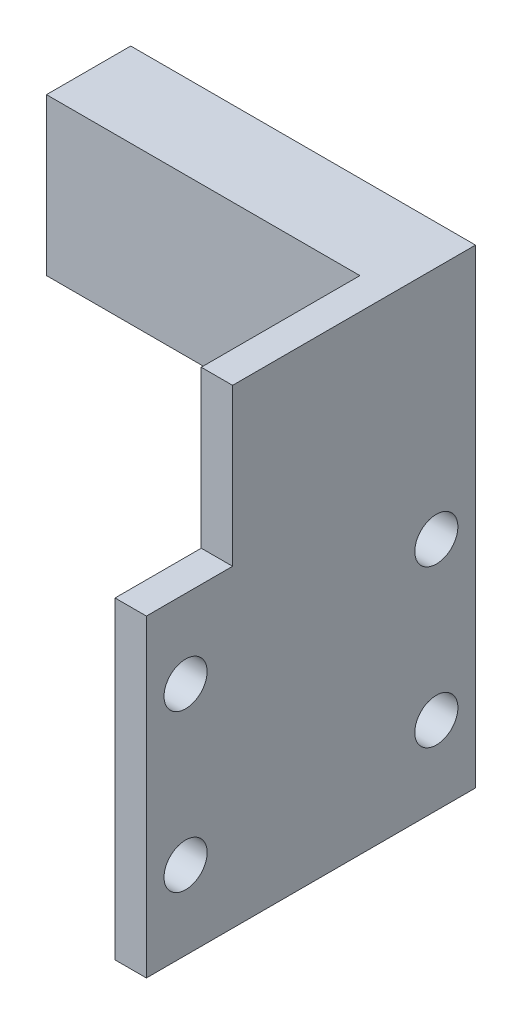
ISO-10303-21;
HEADER;
FILE_DESCRIPTION(('STEP AP214'),'2;1');
FILE_NAME('part.step','',(''),(''),'','','');
FILE_SCHEMA(('AUTOMOTIVE_DESIGN { 1 0 10303 214 1 1 1 1 }'));
ENDSEC;
DATA;
#1=APPLICATION_CONTEXT('core data for automotive mechanical design processes');
#2=APPLICATION_PROTOCOL_DEFINITION('international standard','automotive_design',2000,#1);
#3=PRODUCT_CONTEXT('',#1,'mechanical');
#4=PRODUCT('Part','Part','',(#3));
#5=PRODUCT_RELATED_PRODUCT_CATEGORY('part','',(#4));
#6=PRODUCT_DEFINITION_FORMATION('','',#4);
#7=PRODUCT_DEFINITION_CONTEXT('part definition',#1,'design');
#8=PRODUCT_DEFINITION('design','',#6,#7);
#9=PRODUCT_DEFINITION_SHAPE('','',#8);
#10=(LENGTH_UNIT() NAMED_UNIT(*) SI_UNIT(.MILLI.,.METRE.));
#11=(NAMED_UNIT(*) PLANE_ANGLE_UNIT() SI_UNIT($,.RADIAN.));
#12=(NAMED_UNIT(*) SI_UNIT($,.STERADIAN.) SOLID_ANGLE_UNIT());
#13=UNCERTAINTY_MEASURE_WITH_UNIT(LENGTH_MEASURE(1.E-05),#10,'distance_accuracy_value','');
#14=(GEOMETRIC_REPRESENTATION_CONTEXT(3) GLOBAL_UNCERTAINTY_ASSIGNED_CONTEXT((#13)) GLOBAL_UNIT_ASSIGNED_CONTEXT((#10,
#11,#12)) REPRESENTATION_CONTEXT('',''));
#15=CARTESIAN_POINT('',(0.,0.,0.));
#16=DIRECTION('',(0.,0.,1.));
#17=DIRECTION('',(1.,0.,0.));
#18=AXIS2_PLACEMENT_3D('',#15,#16,#17);
#19=CARTESIAN_POINT('',(-4.,0.,0.));
#20=DIRECTION('',(0.,0.,1.));
#21=DIRECTION('',(1.,0.,0.));
#22=AXIS2_PLACEMENT_3D('',#19,#20,#21);
#23=PLANE('',#22);
#24=DIRECTION('',(0.,-1.,0.));
#25=VECTOR('',#24,1.);
#26=CARTESIAN_POINT('',(0.,0.,0.));
#27=LINE('',#26,#25);
#28=CARTESIAN_POINT('',(0.,40.,0.));
#29=VERTEX_POINT('',#28);
#30=CARTESIAN_POINT('',(0.,0.,0.));
#31=VERTEX_POINT('',#30);
#32=EDGE_CURVE('E190',#29,#31,#27,.T.);
#33=ORIENTED_EDGE('',*,*,#32,.F.);
#34=DIRECTION('',(1.,0.,0.));
#35=VECTOR('',#34,1.);
#36=CARTESIAN_POINT('',(-4.,40.,0.));
#37=LINE('',#36,#35);
#38=CARTESIAN_POINT('',(-4.,40.,0.));
#39=VERTEX_POINT('',#38);
#40=EDGE_CURVE('E11',#39,#29,#37,.T.);
#41=ORIENTED_EDGE('',*,*,#40,.F.);
#42=DIRECTION('',(0.,-1.,0.));
#43=VECTOR('',#42,1.);
#44=CARTESIAN_POINT('',(-4.,0.,0.));
#45=LINE('',#44,#43);
#46=CARTESIAN_POINT('',(-4.,0.,0.));
#47=VERTEX_POINT('',#46);
#48=EDGE_CURVE('E193',#39,#47,#45,.T.);
#49=ORIENTED_EDGE('',*,*,#48,.T.);
#50=DIRECTION('',(1.,0.,0.));
#51=VECTOR('',#50,1.);
#52=CARTESIAN_POINT('',(-4.,0.,0.));
#53=LINE('',#52,#51);
#54=EDGE_CURVE('E44',#47,#31,#53,.T.);
#55=ORIENTED_EDGE('',*,*,#54,.T.);
#56=EDGE_LOOP('',(#33,#41,#49,#55));
#57=FACE_BOUND('',#56,.T.);
#58=ADVANCED_FACE('F41',(#57),#23,.T.);
#59=CARTESIAN_POINT('',(-4.,40.,0.));
#60=DIRECTION('',(0.,1.,0.));
#61=DIRECTION('',(0.,0.,1.));
#62=AXIS2_PLACEMENT_3D('',#59,#60,#61);
#63=PLANE('',#62);
#64=DIRECTION('',(1.,0.,0.));
#65=VECTOR('',#64,1.);
#66=CARTESIAN_POINT('',(-4.,40.,-11.));
#67=LINE('',#66,#65);
#68=CARTESIAN_POINT('',(-4.,40.,-11.));
#69=VERTEX_POINT('',#68);
#70=CARTESIAN_POINT('',(0.,40.,-11.));
#71=VERTEX_POINT('',#70);
#72=EDGE_CURVE('E57',#69,#71,#67,.T.);
#73=ORIENTED_EDGE('',*,*,#72,.F.);
#74=DIRECTION('',(0.,0.,1.));
#75=VECTOR('',#74,1.);
#76=CARTESIAN_POINT('',(-4.,40.,0.));
#77=LINE('',#76,#75);
#78=EDGE_CURVE('E201',#69,#39,#77,.T.);
#79=ORIENTED_EDGE('',*,*,#78,.T.);
#80=ORIENTED_EDGE('',*,*,#40,.T.);
#81=DIRECTION('',(0.,0.,1.));
#82=VECTOR('',#81,1.);
#83=CARTESIAN_POINT('',(0.,40.,0.));
#84=LINE('',#83,#82);
#85=EDGE_CURVE('E126',#71,#29,#84,.T.);
#86=ORIENTED_EDGE('',*,*,#85,.F.);
#87=EDGE_LOOP('',(#73,#79,#80,#86));
#88=FACE_BOUND('',#87,.T.);
#89=ADVANCED_FACE('F212',(#88),#63,.T.);
#90=CARTESIAN_POINT('',(-4.,0.,-42.));
#91=DIRECTION('',(0.,0.,-1.));
#92=DIRECTION('',(-1.,0.,0.));
#93=AXIS2_PLACEMENT_3D('',#90,#91,#92);
#94=PLANE('',#93);
#95=DIRECTION('',(0.,1.,0.));
#96=VECTOR('',#95,1.);
#97=CARTESIAN_POINT('',(0.,0.,-42.));
#98=LINE('',#97,#96);
#99=CARTESIAN_POINT('',(0.,0.,-42.));
#100=VERTEX_POINT('',#99);
#101=CARTESIAN_POINT('',(0.,60.,-42.));
#102=VERTEX_POINT('',#101);
#103=EDGE_CURVE('E116',#100,#102,#98,.T.);
#104=ORIENTED_EDGE('',*,*,#103,.F.);
#105=DIRECTION('',(1.,0.,0.));
#106=VECTOR('',#105,1.);
#107=CARTESIAN_POINT('',(-4.,0.,-42.));
#108=LINE('',#107,#106);
#109=CARTESIAN_POINT('',(-4.,0.,-42.));
#110=VERTEX_POINT('',#109);
#111=EDGE_CURVE('E49',#110,#100,#108,.T.);
#112=ORIENTED_EDGE('',*,*,#111,.F.);
#113=DIRECTION('',(0.,1.,0.));
#114=VECTOR('',#113,1.);
#115=CARTESIAN_POINT('',(-4.,0.,-42.));
#116=LINE('',#115,#114);
#117=CARTESIAN_POINT('',(-4.,40.,-42.));
#118=VERTEX_POINT('',#117);
#119=EDGE_CURVE('E199',#110,#118,#116,.T.);
#120=ORIENTED_EDGE('',*,*,#119,.T.);
#121=DIRECTION('',(-1.,0.,0.));
#122=VECTOR('',#121,1.);
#123=CARTESIAN_POINT('',(0.,40.,-42.));
#124=LINE('',#123,#122);
#125=CARTESIAN_POINT('',(-44.,40.,-42.));
#126=VERTEX_POINT('',#125);
#127=EDGE_CURVE('E152',#118,#126,#124,.T.);
#128=ORIENTED_EDGE('',*,*,#127,.T.);
#129=DIRECTION('',(0.,-1.,0.));
#130=VECTOR('',#129,1.);
#131=CARTESIAN_POINT('',(-44.,60.,-42.));
#132=LINE('',#131,#130);
#133=CARTESIAN_POINT('',(-44.,60.,-42.));
#134=VERTEX_POINT('',#133);
#135=EDGE_CURVE('E132',#134,#126,#132,.T.);
#136=ORIENTED_EDGE('',*,*,#135,.F.);
#137=DIRECTION('',(-1.,0.,0.));
#138=VECTOR('',#137,1.);
#139=CARTESIAN_POINT('',(0.,60.,-42.));
#140=LINE('',#139,#138);
#141=EDGE_CURVE('E129',#102,#134,#140,.T.);
#142=ORIENTED_EDGE('',*,*,#141,.F.);
#143=EDGE_LOOP('',(#104,#112,#120,#128,#136,#142));
#144=FACE_BOUND('',#143,.T.);
#145=ADVANCED_FACE('F130',(#144),#94,.T.);
#146=CARTESIAN_POINT('',(-4.,0.,0.));
#147=DIRECTION('',(0.,-1.,0.));
#148=DIRECTION('',(0.,0.,-1.));
#149=AXIS2_PLACEMENT_3D('',#146,#147,#148);
#150=PLANE('',#149);
#151=DIRECTION('',(0.,0.,-1.));
#152=VECTOR('',#151,1.);
#153=CARTESIAN_POINT('',(0.,0.,0.));
#154=LINE('',#153,#152);
#155=EDGE_CURVE('E124',#31,#100,#154,.T.);
#156=ORIENTED_EDGE('',*,*,#155,.F.);
#157=ORIENTED_EDGE('',*,*,#54,.F.);
#158=DIRECTION('',(0.,0.,-1.));
#159=VECTOR('',#158,1.);
#160=CARTESIAN_POINT('',(-4.,0.,0.));
#161=LINE('',#160,#159);
#162=EDGE_CURVE('E196',#47,#110,#161,.T.);
#163=ORIENTED_EDGE('',*,*,#162,.T.);
#164=ORIENTED_EDGE('',*,*,#111,.T.);
#165=EDGE_LOOP('',(#156,#157,#163,#164));
#166=FACE_BOUND('',#165,.T.);
#167=ADVANCED_FACE('F211',(#166),#150,.T.);
#168=CARTESIAN_POINT('',(-4.,0.,0.));
#169=DIRECTION('',(-1.,0.,0.));
#170=DIRECTION('',(0.,0.,1.));
#171=AXIS2_PLACEMENT_3D('',#168,#169,#170);
#172=PLANE('',#171);
#173=CARTESIAN_POINT('',(-4.,30.,-37.));
#174=DIRECTION('',(1.,0.,0.));
#175=DIRECTION('',(0.,0.,1.));
#176=AXIS2_PLACEMENT_3D('',#173,#174,#175);
#177=CIRCLE('',#176,2.75);
#178=CARTESIAN_POINT('',(-4.,30.,-34.25));
#179=VERTEX_POINT('',#178);
#180=EDGE_CURVE('E169',#179,#179,#177,.T.);
#181=ORIENTED_EDGE('',*,*,#180,.T.);
#182=EDGE_LOOP('',(#181));
#183=FACE_BOUND('',#182,.T.);
#184=CARTESIAN_POINT('',(-4.,10.,-37.));
#185=DIRECTION('',(1.,0.,0.));
#186=DIRECTION('',(0.,0.,-1.));
#187=AXIS2_PLACEMENT_3D('',#184,#185,#186);
#188=CIRCLE('',#187,2.75);
#189=CARTESIAN_POINT('',(-4.,10.,-39.75));
#190=VERTEX_POINT('',#189);
#191=EDGE_CURVE('E175',#190,#190,#188,.T.);
#192=ORIENTED_EDGE('',*,*,#191,.T.);
#193=EDGE_LOOP('',(#192));
#194=FACE_BOUND('',#193,.T.);
#195=CARTESIAN_POINT('',(-4.,10.,-5.));
#196=DIRECTION('',(1.,0.,0.));
#197=DIRECTION('',(0.,0.,1.));
#198=AXIS2_PLACEMENT_3D('',#195,#196,#197);
#199=CIRCLE('',#198,2.75);
#200=CARTESIAN_POINT('',(-4.,10.,-2.25));
#201=VERTEX_POINT('',#200);
#202=EDGE_CURVE('E181',#201,#201,#199,.T.);
#203=ORIENTED_EDGE('',*,*,#202,.T.);
#204=EDGE_LOOP('',(#203));
#205=FACE_BOUND('',#204,.T.);
#206=CARTESIAN_POINT('',(-4.,30.,-5.));
#207=DIRECTION('',(1.,0.,0.));
#208=DIRECTION('',(0.,0.,-1.));
#209=AXIS2_PLACEMENT_3D('',#206,#207,#208);
#210=CIRCLE('',#209,2.75);
#211=CARTESIAN_POINT('',(-4.,30.,-7.75));
#212=VERTEX_POINT('',#211);
#213=EDGE_CURVE('E187',#212,#212,#210,.T.);
#214=ORIENTED_EDGE('',*,*,#213,.T.);
#215=EDGE_LOOP('',(#214));
#216=FACE_BOUND('',#215,.T.);
#217=ORIENTED_EDGE('',*,*,#48,.F.);
#218=ORIENTED_EDGE('',*,*,#78,.F.);
#219=DIRECTION('',(0.,-1.,0.));
#220=VECTOR('',#219,1.);
#221=CARTESIAN_POINT('',(-4.,60.,-11.));
#222=LINE('',#221,#220);
#223=CARTESIAN_POINT('',(-4.,60.,-11.));
#224=VERTEX_POINT('',#223);
#225=EDGE_CURVE('E158',#224,#69,#222,.T.);
#226=ORIENTED_EDGE('',*,*,#225,.F.);
#227=DIRECTION('',(0.,0.,1.));
#228=VECTOR('',#227,1.);
#229=CARTESIAN_POINT('',(-4.,60.,-31.25));
#230=LINE('',#229,#228);
#231=CARTESIAN_POINT('',(-4.,60.,-31.25));
#232=VERTEX_POINT('',#231);
#233=EDGE_CURVE('E148',#232,#224,#230,.T.);
#234=ORIENTED_EDGE('',*,*,#233,.F.);
#235=DIRECTION('',(0.,-1.,0.));
#236=VECTOR('',#235,1.);
#237=CARTESIAN_POINT('',(-4.,60.,-31.25));
#238=LINE('',#237,#236);
#239=CARTESIAN_POINT('',(-4.,40.,-31.25));
#240=VERTEX_POINT('',#239);
#241=EDGE_CURVE('E161',#232,#240,#238,.T.);
#242=ORIENTED_EDGE('',*,*,#241,.T.);
#243=EDGE_CURVE('E65',#118,#240,#77,.T.);
#244=ORIENTED_EDGE('',*,*,#243,.F.);
#245=ORIENTED_EDGE('',*,*,#119,.F.);
#246=ORIENTED_EDGE('',*,*,#162,.F.);
#247=EDGE_LOOP('',(#217,#218,#226,#234,#242,#244,#245,#246));
#248=FACE_BOUND('',#247,.T.);
#249=ADVANCED_FACE('F214',(#183,#194,#205,#216,#248),#172,.T.);
#250=CARTESIAN_POINT('',(0.,0.,0.));
#251=DIRECTION('',(-1.,0.,0.));
#252=DIRECTION('',(0.,0.,1.));
#253=AXIS2_PLACEMENT_3D('',#250,#251,#252);
#254=PLANE('',#253);
#255=CARTESIAN_POINT('',(0.,30.,-37.));
#256=DIRECTION('',(1.,0.,0.));
#257=DIRECTION('',(0.,0.,1.));
#258=AXIS2_PLACEMENT_3D('',#255,#256,#257);
#259=CIRCLE('',#258,2.75);
#260=CARTESIAN_POINT('',(0.,30.,-34.25));
#261=VERTEX_POINT('',#260);
#262=EDGE_CURVE('E168',#261,#261,#259,.T.);
#263=ORIENTED_EDGE('',*,*,#262,.F.);
#264=EDGE_LOOP('',(#263));
#265=FACE_BOUND('',#264,.T.);
#266=CARTESIAN_POINT('',(0.,10.,-37.));
#267=DIRECTION('',(1.,0.,0.));
#268=DIRECTION('',(0.,0.,-1.));
#269=AXIS2_PLACEMENT_3D('',#266,#267,#268);
#270=CIRCLE('',#269,2.75);
#271=CARTESIAN_POINT('',(0.,10.,-39.75));
#272=VERTEX_POINT('',#271);
#273=EDGE_CURVE('E172',#272,#272,#270,.T.);
#274=ORIENTED_EDGE('',*,*,#273,.F.);
#275=EDGE_LOOP('',(#274));
#276=FACE_BOUND('',#275,.T.);
#277=CARTESIAN_POINT('',(0.,10.,-5.));
#278=DIRECTION('',(1.,0.,0.));
#279=DIRECTION('',(0.,0.,1.));
#280=AXIS2_PLACEMENT_3D('',#277,#278,#279);
#281=CIRCLE('',#280,2.75);
#282=CARTESIAN_POINT('',(0.,10.,-2.25));
#283=VERTEX_POINT('',#282);
#284=EDGE_CURVE('E178',#283,#283,#281,.T.);
#285=ORIENTED_EDGE('',*,*,#284,.F.);
#286=EDGE_LOOP('',(#285));
#287=FACE_BOUND('',#286,.T.);
#288=CARTESIAN_POINT('',(0.,30.,-5.));
#289=DIRECTION('',(1.,0.,0.));
#290=DIRECTION('',(0.,0.,-1.));
#291=AXIS2_PLACEMENT_3D('',#288,#289,#290);
#292=CIRCLE('',#291,2.75);
#293=CARTESIAN_POINT('',(0.,30.,-7.75));
#294=VERTEX_POINT('',#293);
#295=EDGE_CURVE('E184',#294,#294,#292,.T.);
#296=ORIENTED_EDGE('',*,*,#295,.F.);
#297=EDGE_LOOP('',(#296));
#298=FACE_BOUND('',#297,.T.);
#299=ORIENTED_EDGE('',*,*,#32,.T.);
#300=ORIENTED_EDGE('',*,*,#155,.T.);
#301=ORIENTED_EDGE('',*,*,#103,.T.);
#302=DIRECTION('',(0.,0.,-1.));
#303=VECTOR('',#302,1.);
#304=CARTESIAN_POINT('',(0.,60.,-11.));
#305=LINE('',#304,#303);
#306=CARTESIAN_POINT('',(0.,60.,-11.));
#307=VERTEX_POINT('',#306);
#308=EDGE_CURVE('E122',#307,#102,#305,.T.);
#309=ORIENTED_EDGE('',*,*,#308,.F.);
#310=DIRECTION('',(0.,-1.,0.));
#311=VECTOR('',#310,1.);
#312=CARTESIAN_POINT('',(0.,60.,-11.));
#313=LINE('',#312,#311);
#314=EDGE_CURVE('E151',#307,#71,#313,.T.);
#315=ORIENTED_EDGE('',*,*,#314,.T.);
#316=ORIENTED_EDGE('',*,*,#85,.T.);
#317=EDGE_LOOP('',(#299,#300,#301,#309,#315,#316));
#318=FACE_BOUND('',#317,.T.);
#319=ADVANCED_FACE('F119',(#265,#276,#287,#298,#318),#254,.F.);
#320=CARTESIAN_POINT('',(-4.,30.,-5.));
#321=DIRECTION('',(1.,0.,0.));
#322=DIRECTION('',(0.,0.,-1.));
#323=AXIS2_PLACEMENT_3D('',#320,#321,#322);
#324=CYLINDRICAL_SURFACE('',#323,2.75);
#325=ORIENTED_EDGE('',*,*,#213,.F.);
#326=EDGE_LOOP('',(#325));
#327=FACE_BOUND('',#326,.T.);
#328=ORIENTED_EDGE('',*,*,#295,.T.);
#329=EDGE_LOOP('',(#328));
#330=FACE_BOUND('',#329,.T.);
#331=ADVANCED_FACE('F259',(#327,#330),#324,.F.);
#332=CARTESIAN_POINT('',(-4.,10.,-5.));
#333=DIRECTION('',(1.,0.,0.));
#334=DIRECTION('',(0.,0.,-1.));
#335=AXIS2_PLACEMENT_3D('',#332,#333,#334);
#336=CYLINDRICAL_SURFACE('',#335,2.75);
#337=ORIENTED_EDGE('',*,*,#202,.F.);
#338=EDGE_LOOP('',(#337));
#339=FACE_BOUND('',#338,.T.);
#340=ORIENTED_EDGE('',*,*,#284,.T.);
#341=EDGE_LOOP('',(#340));
#342=FACE_BOUND('',#341,.T.);
#343=ADVANCED_FACE('F264',(#339,#342),#336,.F.);
#344=CARTESIAN_POINT('',(-4.,10.,-37.));
#345=DIRECTION('',(1.,0.,0.));
#346=DIRECTION('',(0.,0.,-1.));
#347=AXIS2_PLACEMENT_3D('',#344,#345,#346);
#348=CYLINDRICAL_SURFACE('',#347,2.75);
#349=ORIENTED_EDGE('',*,*,#191,.F.);
#350=EDGE_LOOP('',(#349));
#351=FACE_BOUND('',#350,.T.);
#352=ORIENTED_EDGE('',*,*,#273,.T.);
#353=EDGE_LOOP('',(#352));
#354=FACE_BOUND('',#353,.T.);
#355=ADVANCED_FACE('F268',(#351,#354),#348,.F.);
#356=CARTESIAN_POINT('',(-4.,30.,-37.));
#357=DIRECTION('',(1.,0.,0.));
#358=DIRECTION('',(0.,0.,-1.));
#359=AXIS2_PLACEMENT_3D('',#356,#357,#358);
#360=CYLINDRICAL_SURFACE('',#359,2.75);
#361=ORIENTED_EDGE('',*,*,#180,.F.);
#362=EDGE_LOOP('',(#361));
#363=FACE_BOUND('',#362,.T.);
#364=ORIENTED_EDGE('',*,*,#262,.T.);
#365=EDGE_LOOP('',(#364));
#366=FACE_BOUND('',#365,.T.);
#367=ADVANCED_FACE('F272',(#363,#366),#360,.F.);
#368=CARTESIAN_POINT('',(0.,40.,0.));
#369=DIRECTION('',(0.,1.,0.));
#370=DIRECTION('',(0.,0.,1.));
#371=AXIS2_PLACEMENT_3D('',#368,#369,#370);
#372=PLANE('',#371);
#373=ORIENTED_EDGE('',*,*,#127,.F.);
#374=ORIENTED_EDGE('',*,*,#243,.T.);
#375=DIRECTION('',(1.,0.,0.));
#376=VECTOR('',#375,1.);
#377=CARTESIAN_POINT('',(-44.,40.,-31.25));
#378=LINE('',#377,#376);
#379=CARTESIAN_POINT('',(-44.,40.,-31.25));
#380=VERTEX_POINT('',#379);
#381=EDGE_CURVE('E142',#380,#240,#378,.T.);
#382=ORIENTED_EDGE('',*,*,#381,.F.);
#383=DIRECTION('',(0.,0.,1.));
#384=VECTOR('',#383,1.);
#385=CARTESIAN_POINT('',(-44.,40.,-42.));
#386=LINE('',#385,#384);
#387=EDGE_CURVE('E154',#126,#380,#386,.T.);
#388=ORIENTED_EDGE('',*,*,#387,.F.);
#389=EDGE_LOOP('',(#373,#374,#382,#388));
#390=FACE_BOUND('',#389,.T.);
#391=ADVANCED_FACE('F221',(#390),#372,.F.);
#392=CARTESIAN_POINT('',(-44.,60.,-42.));
#393=DIRECTION('',(1.,0.,0.));
#394=DIRECTION('',(0.,0.,-1.));
#395=AXIS2_PLACEMENT_3D('',#392,#393,#394);
#396=PLANE('',#395);
#397=ORIENTED_EDGE('',*,*,#387,.T.);
#398=DIRECTION('',(0.,-1.,0.));
#399=VECTOR('',#398,1.);
#400=CARTESIAN_POINT('',(-44.,60.,-31.25));
#401=LINE('',#400,#399);
#402=CARTESIAN_POINT('',(-44.,60.,-31.25));
#403=VERTEX_POINT('',#402);
#404=EDGE_CURVE('E164',#403,#380,#401,.T.);
#405=ORIENTED_EDGE('',*,*,#404,.F.);
#406=DIRECTION('',(0.,0.,1.));
#407=VECTOR('',#406,1.);
#408=CARTESIAN_POINT('',(-44.,60.,-42.));
#409=LINE('',#408,#407);
#410=EDGE_CURVE('E135',#134,#403,#409,.T.);
#411=ORIENTED_EDGE('',*,*,#410,.F.);
#412=ORIENTED_EDGE('',*,*,#135,.T.);
#413=EDGE_LOOP('',(#397,#405,#411,#412));
#414=FACE_BOUND('',#413,.T.);
#415=ADVANCED_FACE('F219',(#414),#396,.F.);
#416=CARTESIAN_POINT('',(-44.,60.,-31.25));
#417=DIRECTION('',(0.,0.,-1.));
#418=DIRECTION('',(-1.,0.,0.));
#419=AXIS2_PLACEMENT_3D('',#416,#417,#418);
#420=PLANE('',#419);
#421=ORIENTED_EDGE('',*,*,#381,.T.);
#422=ORIENTED_EDGE('',*,*,#241,.F.);
#423=DIRECTION('',(1.,0.,0.));
#424=VECTOR('',#423,1.);
#425=CARTESIAN_POINT('',(-44.,60.,-31.25));
#426=LINE('',#425,#424);
#427=EDGE_CURVE('E146',#403,#232,#426,.T.);
#428=ORIENTED_EDGE('',*,*,#427,.F.);
#429=ORIENTED_EDGE('',*,*,#404,.T.);
#430=EDGE_LOOP('',(#421,#422,#428,#429));
#431=FACE_BOUND('',#430,.T.);
#432=ADVANCED_FACE('F224',(#431),#420,.F.);
#433=CARTESIAN_POINT('',(-4.,60.,-11.));
#434=DIRECTION('',(0.,0.,-1.));
#435=DIRECTION('',(-1.,0.,0.));
#436=AXIS2_PLACEMENT_3D('',#433,#434,#435);
#437=PLANE('',#436);
#438=ORIENTED_EDGE('',*,*,#72,.T.);
#439=ORIENTED_EDGE('',*,*,#314,.F.);
#440=DIRECTION('',(1.,0.,0.));
#441=VECTOR('',#440,1.);
#442=CARTESIAN_POINT('',(-4.,60.,-11.));
#443=LINE('',#442,#441);
#444=EDGE_CURVE('E139',#224,#307,#443,.T.);
#445=ORIENTED_EDGE('',*,*,#444,.F.);
#446=ORIENTED_EDGE('',*,*,#225,.T.);
#447=EDGE_LOOP('',(#438,#439,#445,#446));
#448=FACE_BOUND('',#447,.T.);
#449=ADVANCED_FACE('F228',(#448),#437,.F.);
#450=CARTESIAN_POINT('',(0.,60.,0.));
#451=DIRECTION('',(0.,1.,0.));
#452=DIRECTION('',(0.,0.,1.));
#453=AXIS2_PLACEMENT_3D('',#450,#451,#452);
#454=PLANE('',#453);
#455=ORIENTED_EDGE('',*,*,#308,.T.);
#456=ORIENTED_EDGE('',*,*,#141,.T.);
#457=ORIENTED_EDGE('',*,*,#410,.T.);
#458=ORIENTED_EDGE('',*,*,#427,.T.);
#459=ORIENTED_EDGE('',*,*,#233,.T.);
#460=ORIENTED_EDGE('',*,*,#444,.T.);
#461=EDGE_LOOP('',(#455,#456,#457,#458,#459,#460));
#462=FACE_BOUND('',#461,.T.);
#463=ADVANCED_FACE('F137',(#462),#454,.T.);
#464=CLOSED_SHELL('',(#58,#89,#145,#167,#249,#319,#331,#343,#355,#367,#391,#415,#432,#449,#463));
#465=MANIFOLD_SOLID_BREP('B2',#464);
#466=ADVANCED_BREP_SHAPE_REPRESENTATION('',(#18,#465),#14);
#467=SHAPE_DEFINITION_REPRESENTATION(#9,#466);
ENDSEC;
END-ISO-10303-21;
